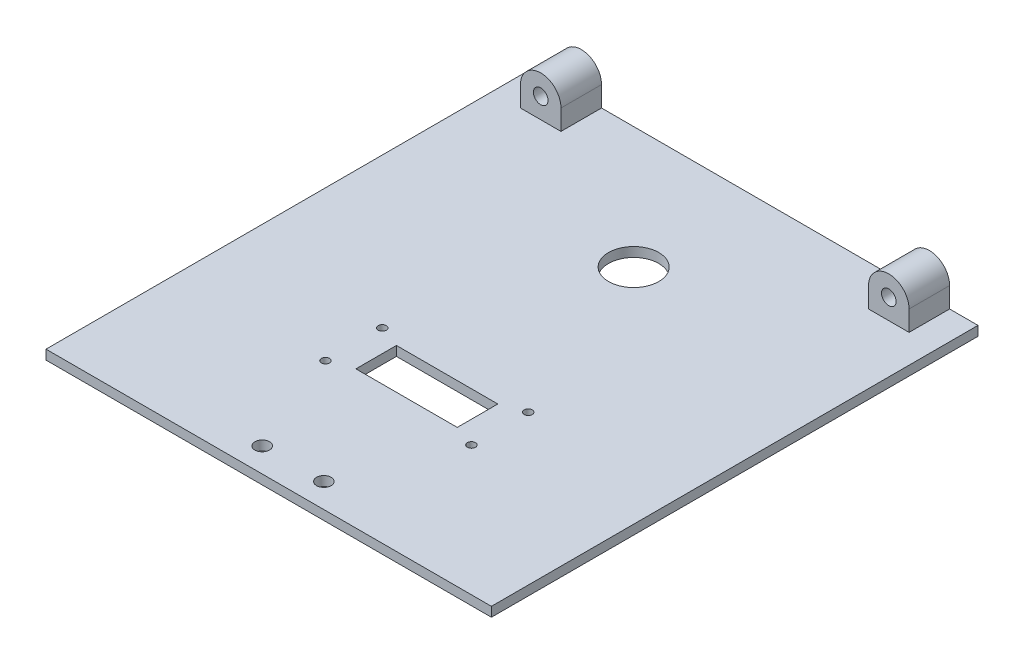
ISO-10303-21;
HEADER;
FILE_DESCRIPTION(('STEP AP214'),'2;1');
FILE_NAME('part.step','',(''),(''),'','','');
FILE_SCHEMA(('AUTOMOTIVE_DESIGN { 1 0 10303 214 1 1 1 1 }'));
ENDSEC;
DATA;
#1=APPLICATION_CONTEXT('core data for automotive mechanical design processes');
#2=APPLICATION_PROTOCOL_DEFINITION('international standard','automotive_design',2000,#1);
#3=PRODUCT_CONTEXT('',#1,'mechanical');
#4=PRODUCT('Part','Part','',(#3));
#5=PRODUCT_RELATED_PRODUCT_CATEGORY('part','',(#4));
#6=PRODUCT_DEFINITION_FORMATION('','',#4);
#7=PRODUCT_DEFINITION_CONTEXT('part definition',#1,'design');
#8=PRODUCT_DEFINITION('design','',#6,#7);
#9=PRODUCT_DEFINITION_SHAPE('','',#8);
#10=(LENGTH_UNIT() NAMED_UNIT(*) SI_UNIT(.MILLI.,.METRE.));
#11=(NAMED_UNIT(*) PLANE_ANGLE_UNIT() SI_UNIT($,.RADIAN.));
#12=(NAMED_UNIT(*) SI_UNIT($,.STERADIAN.) SOLID_ANGLE_UNIT());
#13=UNCERTAINTY_MEASURE_WITH_UNIT(LENGTH_MEASURE(1.E-05),#10,'distance_accuracy_value','');
#14=(GEOMETRIC_REPRESENTATION_CONTEXT(3) GLOBAL_UNCERTAINTY_ASSIGNED_CONTEXT((#13)) GLOBAL_UNIT_ASSIGNED_CONTEXT((#10,
#11,#12)) REPRESENTATION_CONTEXT('',''));
#15=CARTESIAN_POINT('',(0.,0.,0.));
#16=DIRECTION('',(0.,0.,1.));
#17=DIRECTION('',(1.,0.,0.));
#18=AXIS2_PLACEMENT_3D('',#15,#16,#17);
#19=CARTESIAN_POINT('',(0.,6.35,0.));
#20=DIRECTION('',(1.,0.,0.));
#21=DIRECTION('',(0.,0.,-1.));
#22=AXIS2_PLACEMENT_3D('',#19,#20,#21);
#23=PLANE('',#22);
#24=DIRECTION('',(0.,0.,1.));
#25=VECTOR('',#24,1.);
#26=CARTESIAN_POINT('',(0.,2.975,-152.4));
#27=LINE('',#26,#25);
#28=CARTESIAN_POINT('',(0.,2.975,-152.4));
#29=VERTEX_POINT('',#28);
#30=CARTESIAN_POINT('',(0.,2.975,0.));
#31=VERTEX_POINT('',#30);
#32=EDGE_CURVE('E270',#29,#31,#27,.T.);
#33=ORIENTED_EDGE('',*,*,#32,.F.);
#34=DIRECTION('',(0.,-1.,0.));
#35=VECTOR('',#34,1.);
#36=CARTESIAN_POINT('',(0.,6.35,-152.4));
#37=LINE('',#36,#35);
#38=CARTESIAN_POINT('',(0.,0.,-152.4));
#39=VERTEX_POINT('',#38);
#40=EDGE_CURVE('E299',#29,#39,#37,.T.);
#41=ORIENTED_EDGE('',*,*,#40,.T.);
#42=DIRECTION('',(0.,0.,1.));
#43=VECTOR('',#42,1.);
#44=CARTESIAN_POINT('',(0.,0.,0.));
#45=LINE('',#44,#43);
#46=CARTESIAN_POINT('',(0.,0.,0.));
#47=VERTEX_POINT('',#46);
#48=EDGE_CURVE('E286',#39,#47,#45,.T.);
#49=ORIENTED_EDGE('',*,*,#48,.T.);
#50=DIRECTION('',(0.,-1.,0.));
#51=VECTOR('',#50,1.);
#52=CARTESIAN_POINT('',(0.,6.35,0.));
#53=LINE('',#52,#51);
#54=EDGE_CURVE('E305',#31,#47,#53,.T.);
#55=ORIENTED_EDGE('',*,*,#54,.F.);
#56=EDGE_LOOP('',(#33,#41,#49,#55));
#57=FACE_BOUND('',#56,.T.);
#58=ADVANCED_FACE('F36',(#57),#23,.F.);
#59=CARTESIAN_POINT('',(0.,6.35,0.));
#60=DIRECTION('',(0.,0.,-1.));
#61=DIRECTION('',(-1.,0.,0.));
#62=AXIS2_PLACEMENT_3D('',#59,#60,#61);
#63=PLANE('',#62);
#64=DIRECTION('',(1.,0.,0.));
#65=VECTOR('',#64,1.);
#66=CARTESIAN_POINT('',(0.,2.975,0.));
#67=LINE('',#66,#65);
#68=CARTESIAN_POINT('',(139.5,2.975,0.));
#69=VERTEX_POINT('',#68);
#70=EDGE_CURVE('E278',#31,#69,#67,.T.);
#71=ORIENTED_EDGE('',*,*,#70,.F.);
#72=ORIENTED_EDGE('',*,*,#54,.T.);
#73=DIRECTION('',(1.,0.,0.));
#74=VECTOR('',#73,1.);
#75=CARTESIAN_POINT('',(0.,0.,0.));
#76=LINE('',#75,#74);
#77=CARTESIAN_POINT('',(139.5,0.,0.));
#78=VERTEX_POINT('',#77);
#79=EDGE_CURVE('E290',#47,#78,#76,.T.);
#80=ORIENTED_EDGE('',*,*,#79,.T.);
#81=DIRECTION('',(0.,-1.,0.));
#82=VECTOR('',#81,1.);
#83=CARTESIAN_POINT('',(139.5,6.35,0.));
#84=LINE('',#83,#82);
#85=EDGE_CURVE('E303',#69,#78,#84,.T.);
#86=ORIENTED_EDGE('',*,*,#85,.F.);
#87=EDGE_LOOP('',(#71,#72,#80,#86));
#88=FACE_BOUND('',#87,.T.);
#89=ADVANCED_FACE('F376',(#88),#63,.F.);
#90=CARTESIAN_POINT('',(139.5,6.35,0.));
#91=DIRECTION('',(-1.,0.,0.));
#92=DIRECTION('',(0.,0.,1.));
#93=AXIS2_PLACEMENT_3D('',#90,#91,#92);
#94=PLANE('',#93);
#95=DIRECTION('',(0.,0.,-1.));
#96=VECTOR('',#95,1.);
#97=CARTESIAN_POINT('',(139.5,2.975,-152.4));
#98=LINE('',#97,#96);
#99=CARTESIAN_POINT('',(139.5,2.975,-152.4));
#100=VERTEX_POINT('',#99);
#101=EDGE_CURVE('E280',#69,#100,#98,.T.);
#102=ORIENTED_EDGE('',*,*,#101,.F.);
#103=ORIENTED_EDGE('',*,*,#85,.T.);
#104=DIRECTION('',(0.,0.,-1.));
#105=VECTOR('',#104,1.);
#106=CARTESIAN_POINT('',(139.5,0.,0.));
#107=LINE('',#106,#105);
#108=CARTESIAN_POINT('',(139.5,0.,-152.4));
#109=VERTEX_POINT('',#108);
#110=EDGE_CURVE('E293',#78,#109,#107,.T.);
#111=ORIENTED_EDGE('',*,*,#110,.T.);
#112=DIRECTION('',(0.,-1.,0.));
#113=VECTOR('',#112,1.);
#114=CARTESIAN_POINT('',(139.5,6.35,-152.4));
#115=LINE('',#114,#113);
#116=EDGE_CURVE('E301',#100,#109,#115,.T.);
#117=ORIENTED_EDGE('',*,*,#116,.F.);
#118=EDGE_LOOP('',(#102,#103,#111,#117));
#119=FACE_BOUND('',#118,.T.);
#120=ADVANCED_FACE('F381',(#119),#94,.F.);
#121=CARTESIAN_POINT('',(0.,6.35,-152.4));
#122=DIRECTION('',(0.,0.,1.));
#123=DIRECTION('',(1.,0.,0.));
#124=AXIS2_PLACEMENT_3D('',#121,#122,#123);
#125=PLANE('',#124);
#126=DIRECTION('',(-1.,0.,0.));
#127=VECTOR('',#126,1.);
#128=CARTESIAN_POINT('',(0.,2.975,-152.4));
#129=LINE('',#128,#127);
#130=CARTESIAN_POINT('',(130.61,2.975,-152.4));
#131=VERTEX_POINT('',#130);
#132=EDGE_CURVE('E283',#100,#131,#129,.T.);
#133=ORIENTED_EDGE('',*,*,#132,.F.);
#134=ORIENTED_EDGE('',*,*,#116,.T.);
#135=DIRECTION('',(-1.,0.,0.));
#136=VECTOR('',#135,1.);
#137=CARTESIAN_POINT('',(0.,0.,-152.4));
#138=LINE('',#137,#136);
#139=EDGE_CURVE('E296',#109,#39,#138,.T.);
#140=ORIENTED_EDGE('',*,*,#139,.T.);
#141=ORIENTED_EDGE('',*,*,#40,.F.);
#142=CARTESIAN_POINT('',(8.89,2.975,-152.4));
#143=VERTEX_POINT('',#142);
#144=EDGE_CURVE('E282',#143,#29,#129,.T.);
#145=ORIENTED_EDGE('',*,*,#144,.F.);
#146=DIRECTION('',(0.,1.,0.));
#147=VECTOR('',#146,1.);
#148=CARTESIAN_POINT('',(8.89,9.325,-152.4));
#149=LINE('',#148,#147);
#150=CARTESIAN_POINT('',(8.89,9.325,-152.4));
#151=VERTEX_POINT('',#150);
#152=EDGE_CURVE('E215',#143,#151,#149,.T.);
#153=ORIENTED_EDGE('',*,*,#152,.T.);
#154=CARTESIAN_POINT('',(15.24,9.325,-152.4));
#155=DIRECTION('',(0.,0.,-1.));
#156=DIRECTION('',(-1.,0.,0.));
#157=AXIS2_PLACEMENT_3D('',#154,#155,#156);
#158=CIRCLE('',#157,6.35);
#159=CARTESIAN_POINT('',(21.59,9.325,-152.4));
#160=VERTEX_POINT('',#159);
#161=EDGE_CURVE('E207',#151,#160,#158,.T.);
#162=ORIENTED_EDGE('',*,*,#161,.T.);
#163=DIRECTION('',(0.,-1.,0.));
#164=VECTOR('',#163,1.);
#165=CARTESIAN_POINT('',(21.59,9.325,-152.4));
#166=LINE('',#165,#164);
#167=CARTESIAN_POINT('',(21.59,2.975,-152.4));
#168=VERTEX_POINT('',#167);
#169=EDGE_CURVE('E226',#160,#168,#166,.T.);
#170=ORIENTED_EDGE('',*,*,#169,.T.);
#171=CARTESIAN_POINT('',(117.91,2.975,-152.4));
#172=VERTEX_POINT('',#171);
#173=EDGE_CURVE('E287',#172,#168,#129,.T.);
#174=ORIENTED_EDGE('',*,*,#173,.F.);
#175=DIRECTION('',(0.,1.,0.));
#176=VECTOR('',#175,1.);
#177=CARTESIAN_POINT('',(117.91,9.325,-152.4));
#178=LINE('',#177,#176);
#179=CARTESIAN_POINT('',(117.91,9.325,-152.4));
#180=VERTEX_POINT('',#179);
#181=EDGE_CURVE('E251',#172,#180,#178,.T.);
#182=ORIENTED_EDGE('',*,*,#181,.T.);
#183=CARTESIAN_POINT('',(124.26,9.325,-152.4));
#184=DIRECTION('',(0.,0.,-1.));
#185=DIRECTION('',(-1.,0.,0.));
#186=AXIS2_PLACEMENT_3D('',#183,#184,#185);
#187=CIRCLE('',#186,6.35);
#188=CARTESIAN_POINT('',(130.61,9.325,-152.4));
#189=VERTEX_POINT('',#188);
#190=EDGE_CURVE('E244',#180,#189,#187,.T.);
#191=ORIENTED_EDGE('',*,*,#190,.T.);
#192=DIRECTION('',(0.,-1.,0.));
#193=VECTOR('',#192,1.);
#194=CARTESIAN_POINT('',(130.61,9.325,-152.4));
#195=LINE('',#194,#193);
#196=EDGE_CURVE('E263',#189,#131,#195,.T.);
#197=ORIENTED_EDGE('',*,*,#196,.T.);
#198=EDGE_LOOP('',(#133,#134,#140,#141,#145,#153,#162,#170,#174,#182,#191,#197));
#199=FACE_BOUND('',#198,.T.);
#200=CARTESIAN_POINT('',(124.26,9.325,-152.4));
#201=DIRECTION('',(0.,0.,-1.));
#202=DIRECTION('',(-1.,0.,0.));
#203=AXIS2_PLACEMENT_3D('',#200,#201,#202);
#204=CIRCLE('',#203,2.28599999999999);
#205=CARTESIAN_POINT('',(121.974,9.325,-152.4));
#206=VERTEX_POINT('',#205);
#207=EDGE_CURVE('E233',#206,#206,#204,.T.);
#208=ORIENTED_EDGE('',*,*,#207,.F.);
#209=EDGE_LOOP('',(#208));
#210=FACE_BOUND('',#209,.T.);
#211=CARTESIAN_POINT('',(15.24,9.325,-152.4));
#212=DIRECTION('',(0.,0.,-1.));
#213=DIRECTION('',(-1.,0.,0.));
#214=AXIS2_PLACEMENT_3D('',#211,#212,#213);
#215=CIRCLE('',#214,2.286);
#216=CARTESIAN_POINT('',(12.954,9.325,-152.4));
#217=VERTEX_POINT('',#216);
#218=EDGE_CURVE('E208',#217,#217,#215,.T.);
#219=ORIENTED_EDGE('',*,*,#218,.F.);
#220=EDGE_LOOP('',(#219));
#221=FACE_BOUND('',#220,.T.);
#222=ADVANCED_FACE('F350',(#199,#210,#221),#125,.F.);
#223=CARTESIAN_POINT('',(0.,0.,0.));
#224=DIRECTION('',(0.,-1.,0.));
#225=DIRECTION('',(0.,0.,-1.));
#226=AXIS2_PLACEMENT_3D('',#223,#224,#225);
#227=PLANE('',#226);
#228=CARTESIAN_POINT('',(46.89,0.,-58.42));
#229=DIRECTION('',(0.,-1.,0.));
#230=DIRECTION('',(0.,0.,-1.));
#231=AXIS2_PLACEMENT_3D('',#228,#229,#230);
#232=CIRCLE('',#231,1.27);
#233=CARTESIAN_POINT('',(46.89,0.,-59.69));
#234=VERTEX_POINT('',#233);
#235=EDGE_CURVE('E185',#234,#234,#232,.T.);
#236=ORIENTED_EDGE('',*,*,#235,.F.);
#237=EDGE_LOOP('',(#236));
#238=FACE_BOUND('',#237,.T.);
#239=CARTESIAN_POINT('',(92.61,0.,-58.42));
#240=DIRECTION('',(0.,-1.,0.));
#241=DIRECTION('',(0.,0.,-1.));
#242=AXIS2_PLACEMENT_3D('',#239,#240,#241);
#243=CIRCLE('',#242,1.26999999999999);
#244=CARTESIAN_POINT('',(92.61,0.,-59.69));
#245=VERTEX_POINT('',#244);
#246=EDGE_CURVE('E182',#245,#245,#243,.T.);
#247=ORIENTED_EDGE('',*,*,#246,.F.);
#248=EDGE_LOOP('',(#247));
#249=FACE_BOUND('',#248,.T.);
#250=CARTESIAN_POINT('',(92.61,0.,-40.64));
#251=DIRECTION('',(0.,-1.,0.));
#252=DIRECTION('',(0.,0.,-1.));
#253=AXIS2_PLACEMENT_3D('',#250,#251,#252);
#254=CIRCLE('',#253,1.26999999999999);
#255=CARTESIAN_POINT('',(92.61,0.,-41.91));
#256=VERTEX_POINT('',#255);
#257=EDGE_CURVE('E178',#256,#256,#254,.T.);
#258=ORIENTED_EDGE('',*,*,#257,.F.);
#259=EDGE_LOOP('',(#258));
#260=FACE_BOUND('',#259,.T.);
#261=CARTESIAN_POINT('',(46.89,0.,-40.64));
#262=DIRECTION('',(0.,-1.,0.));
#263=DIRECTION('',(0.,0.,-1.));
#264=AXIS2_PLACEMENT_3D('',#261,#262,#263);
#265=CIRCLE('',#264,1.27);
#266=CARTESIAN_POINT('',(46.89,0.,-41.91));
#267=VERTEX_POINT('',#266);
#268=EDGE_CURVE('E174',#267,#267,#265,.T.);
#269=ORIENTED_EDGE('',*,*,#268,.F.);
#270=EDGE_LOOP('',(#269));
#271=FACE_BOUND('',#270,.T.);
#272=DIRECTION('',(0.,0.,-1.));
#273=VECTOR('',#272,1.);
#274=CARTESIAN_POINT('',(53.875,0.,0.));
#275=LINE('',#274,#273);
#276=CARTESIAN_POINT('',(53.875,0.,-43.18));
#277=VERTEX_POINT('',#276);
#278=CARTESIAN_POINT('',(53.875,0.,-55.88));
#279=VERTEX_POINT('',#278);
#280=EDGE_CURVE('E168',#277,#279,#275,.T.);
#281=ORIENTED_EDGE('',*,*,#280,.F.);
#282=DIRECTION('',(-1.,0.,0.));
#283=VECTOR('',#282,1.);
#284=CARTESIAN_POINT('',(0.,0.,-43.18));
#285=LINE('',#284,#283);
#286=CARTESIAN_POINT('',(85.625,0.,-43.18));
#287=VERTEX_POINT('',#286);
#288=EDGE_CURVE('E166',#287,#277,#285,.T.);
#289=ORIENTED_EDGE('',*,*,#288,.F.);
#290=DIRECTION('',(0.,0.,1.));
#291=VECTOR('',#290,1.);
#292=CARTESIAN_POINT('',(85.625,0.,0.));
#293=LINE('',#292,#291);
#294=CARTESIAN_POINT('',(85.625,0.,-55.88));
#295=VERTEX_POINT('',#294);
#296=EDGE_CURVE('E151',#295,#287,#293,.T.);
#297=ORIENTED_EDGE('',*,*,#296,.F.);
#298=DIRECTION('',(1.,0.,0.));
#299=VECTOR('',#298,1.);
#300=CARTESIAN_POINT('',(0.,0.,-55.88));
#301=LINE('',#300,#299);
#302=EDGE_CURVE('E146',#279,#295,#301,.T.);
#303=ORIENTED_EDGE('',*,*,#302,.F.);
#304=EDGE_LOOP('',(#281,#289,#297,#303));
#305=FACE_BOUND('',#304,.T.);
#306=CARTESIAN_POINT('',(60.098,0.,-7.62000000000001));
#307=DIRECTION('',(0.,1.,0.));
#308=DIRECTION('',(0.,0.,1.));
#309=AXIS2_PLACEMENT_3D('',#306,#307,#308);
#310=CIRCLE('',#309,2.28599999999998);
#311=CARTESIAN_POINT('',(60.098,0.,-5.33400000000003));
#312=VERTEX_POINT('',#311);
#313=EDGE_CURVE('E189',#312,#312,#310,.T.);
#314=ORIENTED_EDGE('',*,*,#313,.T.);
#315=EDGE_LOOP('',(#314));
#316=FACE_BOUND('',#315,.T.);
#317=CARTESIAN_POINT('',(79.402,0.,-7.62000000000002));
#318=DIRECTION('',(0.,1.,0.));
#319=DIRECTION('',(0.,0.,1.));
#320=AXIS2_PLACEMENT_3D('',#317,#318,#319);
#321=CIRCLE('',#320,2.28599999999999);
#322=CARTESIAN_POINT('',(79.402,0.,-5.33400000000002));
#323=VERTEX_POINT('',#322);
#324=EDGE_CURVE('E196',#323,#323,#321,.T.);
#325=ORIENTED_EDGE('',*,*,#324,.T.);
#326=EDGE_LOOP('',(#325));
#327=FACE_BOUND('',#326,.T.);
#328=CARTESIAN_POINT('',(69.75,0.,-114.3));
#329=DIRECTION('',(0.,-1.,0.));
#330=DIRECTION('',(0.,0.,-1.));
#331=AXIS2_PLACEMENT_3D('',#328,#329,#330);
#332=CIRCLE('',#331,7.874);
#333=CARTESIAN_POINT('',(69.75,0.,-122.174));
#334=VERTEX_POINT('',#333);
#335=EDGE_CURVE('E192',#334,#334,#332,.T.);
#336=ORIENTED_EDGE('',*,*,#335,.F.);
#337=EDGE_LOOP('',(#336));
#338=FACE_BOUND('',#337,.T.);
#339=ORIENTED_EDGE('',*,*,#48,.F.);
#340=ORIENTED_EDGE('',*,*,#139,.F.);
#341=ORIENTED_EDGE('',*,*,#110,.F.);
#342=ORIENTED_EDGE('',*,*,#79,.F.);
#343=EDGE_LOOP('',(#339,#340,#341,#342));
#344=FACE_BOUND('',#343,.T.);
#345=ADVANCED_FACE('F164',(#238,#249,#260,#271,#305,#316,#327,#338,#344),#227,.T.);
#346=CARTESIAN_POINT('',(0.,2.975,0.));
#347=DIRECTION('',(0.,1.,0.));
#348=DIRECTION('',(0.,0.,1.));
#349=AXIS2_PLACEMENT_3D('',#346,#347,#348);
#350=PLANE('',#349);
#351=CARTESIAN_POINT('',(46.89,2.975,-58.42));
#352=DIRECTION('',(0.,1.,0.));
#353=DIRECTION('',(0.,0.,1.));
#354=AXIS2_PLACEMENT_3D('',#351,#352,#353);
#355=CIRCLE('',#354,1.27);
#356=CARTESIAN_POINT('',(46.89,2.975,-57.15));
#357=VERTEX_POINT('',#356);
#358=EDGE_CURVE('E39',#357,#357,#355,.T.);
#359=ORIENTED_EDGE('',*,*,#358,.F.);
#360=EDGE_LOOP('',(#359));
#361=FACE_BOUND('',#360,.T.);
#362=CARTESIAN_POINT('',(92.61,2.975,-58.42));
#363=DIRECTION('',(0.,1.,0.));
#364=DIRECTION('',(0.,0.,1.));
#365=AXIS2_PLACEMENT_3D('',#362,#363,#364);
#366=CIRCLE('',#365,1.26999999999999);
#367=CARTESIAN_POINT('',(92.61,2.975,-57.15));
#368=VERTEX_POINT('',#367);
#369=EDGE_CURVE('E181',#368,#368,#366,.T.);
#370=ORIENTED_EDGE('',*,*,#369,.F.);
#371=EDGE_LOOP('',(#370));
#372=FACE_BOUND('',#371,.T.);
#373=CARTESIAN_POINT('',(92.61,2.975,-40.64));
#374=DIRECTION('',(0.,1.,0.));
#375=DIRECTION('',(0.,0.,1.));
#376=AXIS2_PLACEMENT_3D('',#373,#374,#375);
#377=CIRCLE('',#376,1.26999999999999);
#378=CARTESIAN_POINT('',(92.61,2.975,-39.37));
#379=VERTEX_POINT('',#378);
#380=EDGE_CURVE('E177',#379,#379,#377,.T.);
#381=ORIENTED_EDGE('',*,*,#380,.F.);
#382=EDGE_LOOP('',(#381));
#383=FACE_BOUND('',#382,.T.);
#384=CARTESIAN_POINT('',(46.89,2.975,-40.64));
#385=DIRECTION('',(0.,1.,0.));
#386=DIRECTION('',(0.,0.,1.));
#387=AXIS2_PLACEMENT_3D('',#384,#385,#386);
#388=CIRCLE('',#387,1.27);
#389=CARTESIAN_POINT('',(46.89,2.975,-39.37));
#390=VERTEX_POINT('',#389);
#391=EDGE_CURVE('E173',#390,#390,#388,.T.);
#392=ORIENTED_EDGE('',*,*,#391,.F.);
#393=EDGE_LOOP('',(#392));
#394=FACE_BOUND('',#393,.T.);
#395=DIRECTION('',(0.,0.,1.));
#396=VECTOR('',#395,1.);
#397=CARTESIAN_POINT('',(53.875,2.975,0.));
#398=LINE('',#397,#396);
#399=CARTESIAN_POINT('',(53.875,2.975,-55.88));
#400=VERTEX_POINT('',#399);
#401=CARTESIAN_POINT('',(53.875,2.975,-43.18));
#402=VERTEX_POINT('',#401);
#403=EDGE_CURVE('E11',#400,#402,#398,.T.);
#404=ORIENTED_EDGE('',*,*,#403,.F.);
#405=DIRECTION('',(-1.,0.,0.));
#406=VECTOR('',#405,1.);
#407=CARTESIAN_POINT('',(0.,2.975,-55.88));
#408=LINE('',#407,#406);
#409=CARTESIAN_POINT('',(85.625,2.975,-55.88));
#410=VERTEX_POINT('',#409);
#411=EDGE_CURVE('E307',#410,#400,#408,.T.);
#412=ORIENTED_EDGE('',*,*,#411,.F.);
#413=DIRECTION('',(0.,0.,-1.));
#414=VECTOR('',#413,1.);
#415=CARTESIAN_POINT('',(85.625,2.975,0.));
#416=LINE('',#415,#414);
#417=CARTESIAN_POINT('',(85.625,2.975,-43.18));
#418=VERTEX_POINT('',#417);
#419=EDGE_CURVE('E159',#418,#410,#416,.T.);
#420=ORIENTED_EDGE('',*,*,#419,.F.);
#421=DIRECTION('',(1.,0.,0.));
#422=VECTOR('',#421,1.);
#423=CARTESIAN_POINT('',(0.,2.975,-43.18));
#424=LINE('',#423,#422);
#425=EDGE_CURVE('E44',#402,#418,#424,.T.);
#426=ORIENTED_EDGE('',*,*,#425,.F.);
#427=EDGE_LOOP('',(#404,#412,#420,#426));
#428=FACE_BOUND('',#427,.T.);
#429=CARTESIAN_POINT('',(60.098,2.975,-7.62000000000001));
#430=DIRECTION('',(0.,1.,0.));
#431=DIRECTION('',(0.,0.,1.));
#432=AXIS2_PLACEMENT_3D('',#429,#430,#431);
#433=CIRCLE('',#432,2.28599999999998);
#434=CARTESIAN_POINT('',(60.098,2.975,-5.33400000000003));
#435=VERTEX_POINT('',#434);
#436=EDGE_CURVE('E193',#435,#435,#433,.T.);
#437=ORIENTED_EDGE('',*,*,#436,.F.);
#438=EDGE_LOOP('',(#437));
#439=FACE_BOUND('',#438,.T.);
#440=CARTESIAN_POINT('',(79.402,2.975,-7.62000000000002));
#441=DIRECTION('',(0.,1.,0.));
#442=DIRECTION('',(0.,0.,1.));
#443=AXIS2_PLACEMENT_3D('',#440,#441,#442);
#444=CIRCLE('',#443,2.28599999999999);
#445=CARTESIAN_POINT('',(79.402,2.975,-5.33400000000002));
#446=VERTEX_POINT('',#445);
#447=EDGE_CURVE('E188',#446,#446,#444,.T.);
#448=ORIENTED_EDGE('',*,*,#447,.F.);
#449=EDGE_LOOP('',(#448));
#450=FACE_BOUND('',#449,.T.);
#451=CARTESIAN_POINT('',(69.75,2.975,-114.3));
#452=DIRECTION('',(0.,1.,0.));
#453=DIRECTION('',(0.,0.,1.));
#454=AXIS2_PLACEMENT_3D('',#451,#452,#453);
#455=CIRCLE('',#454,7.874);
#456=CARTESIAN_POINT('',(69.75,2.975,-106.426));
#457=VERTEX_POINT('',#456);
#458=EDGE_CURVE('E203',#457,#457,#455,.T.);
#459=ORIENTED_EDGE('',*,*,#458,.F.);
#460=EDGE_LOOP('',(#459));
#461=FACE_BOUND('',#460,.T.);
#462=DIRECTION('',(0.,0.,-1.));
#463=VECTOR('',#462,1.);
#464=CARTESIAN_POINT('',(8.89,2.975,-139.7));
#465=LINE('',#464,#463);
#466=CARTESIAN_POINT('',(8.89,2.975,-139.7));
#467=VERTEX_POINT('',#466);
#468=EDGE_CURVE('E234',#467,#143,#465,.T.);
#469=ORIENTED_EDGE('',*,*,#468,.T.);
#470=ORIENTED_EDGE('',*,*,#144,.T.);
#471=ORIENTED_EDGE('',*,*,#32,.T.);
#472=ORIENTED_EDGE('',*,*,#70,.T.);
#473=ORIENTED_EDGE('',*,*,#101,.T.);
#474=ORIENTED_EDGE('',*,*,#132,.T.);
#475=DIRECTION('',(0.,0.,-1.));
#476=VECTOR('',#475,1.);
#477=CARTESIAN_POINT('',(130.61,2.975,-139.7));
#478=LINE('',#477,#476);
#479=CARTESIAN_POINT('',(130.61,2.975,-139.7));
#480=VERTEX_POINT('',#479);
#481=EDGE_CURVE('E274',#480,#131,#478,.T.);
#482=ORIENTED_EDGE('',*,*,#481,.F.);
#483=DIRECTION('',(-1.,0.,0.));
#484=VECTOR('',#483,1.);
#485=CARTESIAN_POINT('',(130.61,2.975,-139.7));
#486=LINE('',#485,#484);
#487=CARTESIAN_POINT('',(117.91,2.975,-139.7));
#488=VERTEX_POINT('',#487);
#489=EDGE_CURVE('E254',#480,#488,#486,.T.);
#490=ORIENTED_EDGE('',*,*,#489,.T.);
#491=DIRECTION('',(0.,0.,-1.));
#492=VECTOR('',#491,1.);
#493=CARTESIAN_POINT('',(117.91,2.975,-139.7));
#494=LINE('',#493,#492);
#495=EDGE_CURVE('E271',#488,#172,#494,.T.);
#496=ORIENTED_EDGE('',*,*,#495,.T.);
#497=ORIENTED_EDGE('',*,*,#173,.T.);
#498=DIRECTION('',(0.,0.,-1.));
#499=VECTOR('',#498,1.);
#500=CARTESIAN_POINT('',(21.59,2.975,-139.7));
#501=LINE('',#500,#499);
#502=CARTESIAN_POINT('',(21.59,2.975,-139.7));
#503=VERTEX_POINT('',#502);
#504=EDGE_CURVE('E237',#503,#168,#501,.T.);
#505=ORIENTED_EDGE('',*,*,#504,.F.);
#506=DIRECTION('',(-1.,0.,0.));
#507=VECTOR('',#506,1.);
#508=CARTESIAN_POINT('',(21.59,2.975,-139.7));
#509=LINE('',#508,#507);
#510=EDGE_CURVE('E218',#503,#467,#509,.T.);
#511=ORIENTED_EDGE('',*,*,#510,.T.);
#512=EDGE_LOOP('',(#469,#470,#471,#472,#473,#474,#482,#490,#496,#497,#505,#511));
#513=FACE_BOUND('',#512,.T.);
#514=ADVANCED_FACE('F321',(#361,#372,#383,#394,#428,#439,#450,#461,#513),#350,.T.);
#515=CARTESIAN_POINT('',(124.26,9.325,-139.7));
#516=DIRECTION('',(0.,0.,-1.));
#517=DIRECTION('',(-1.,0.,0.));
#518=AXIS2_PLACEMENT_3D('',#515,#516,#517);
#519=CYLINDRICAL_SURFACE('',#518,6.35);
#520=ORIENTED_EDGE('',*,*,#190,.F.);
#521=DIRECTION('',(0.,0.,-1.));
#522=VECTOR('',#521,1.);
#523=CARTESIAN_POINT('',(117.91,9.325,-139.7));
#524=LINE('',#523,#522);
#525=CARTESIAN_POINT('',(117.91,9.325,-139.7));
#526=VERTEX_POINT('',#525);
#527=EDGE_CURVE('E268',#526,#180,#524,.T.);
#528=ORIENTED_EDGE('',*,*,#527,.F.);
#529=CARTESIAN_POINT('',(124.26,9.325,-139.7));
#530=DIRECTION('',(0.,0.,-1.));
#531=DIRECTION('',(-1.,0.,0.));
#532=AXIS2_PLACEMENT_3D('',#529,#530,#531);
#533=CIRCLE('',#532,6.35);
#534=CARTESIAN_POINT('',(130.61,9.325,-139.7));
#535=VERTEX_POINT('',#534);
#536=EDGE_CURVE('E247',#526,#535,#533,.T.);
#537=ORIENTED_EDGE('',*,*,#536,.T.);
#538=DIRECTION('',(0.,0.,-1.));
#539=VECTOR('',#538,1.);
#540=CARTESIAN_POINT('',(130.61,9.325,-139.7));
#541=LINE('',#540,#539);
#542=EDGE_CURVE('E260',#535,#189,#541,.T.);
#543=ORIENTED_EDGE('',*,*,#542,.T.);
#544=EDGE_LOOP('',(#520,#528,#537,#543));
#545=FACE_BOUND('',#544,.T.);
#546=ADVANCED_FACE('F324',(#545),#519,.T.);
#547=CARTESIAN_POINT('',(117.91,9.325,-139.7));
#548=DIRECTION('',(-1.,0.,0.));
#549=DIRECTION('',(0.,0.,1.));
#550=AXIS2_PLACEMENT_3D('',#547,#548,#549);
#551=PLANE('',#550);
#552=ORIENTED_EDGE('',*,*,#181,.F.);
#553=ORIENTED_EDGE('',*,*,#495,.F.);
#554=DIRECTION('',(0.,1.,0.));
#555=VECTOR('',#554,1.);
#556=CARTESIAN_POINT('',(117.91,9.325,-139.7));
#557=LINE('',#556,#555);
#558=EDGE_CURVE('E257',#488,#526,#557,.T.);
#559=ORIENTED_EDGE('',*,*,#558,.T.);
#560=ORIENTED_EDGE('',*,*,#527,.T.);
#561=EDGE_LOOP('',(#552,#553,#559,#560));
#562=FACE_BOUND('',#561,.T.);
#563=ADVANCED_FACE('F402',(#562),#551,.T.);
#564=CARTESIAN_POINT('',(130.61,9.325,-139.7));
#565=DIRECTION('',(1.,0.,0.));
#566=DIRECTION('',(0.,0.,-1.));
#567=AXIS2_PLACEMENT_3D('',#564,#565,#566);
#568=PLANE('',#567);
#569=ORIENTED_EDGE('',*,*,#196,.F.);
#570=ORIENTED_EDGE('',*,*,#542,.F.);
#571=DIRECTION('',(0.,-1.,0.));
#572=VECTOR('',#571,1.);
#573=CARTESIAN_POINT('',(130.61,9.325,-139.7));
#574=LINE('',#573,#572);
#575=EDGE_CURVE('E250',#535,#480,#574,.T.);
#576=ORIENTED_EDGE('',*,*,#575,.T.);
#577=ORIENTED_EDGE('',*,*,#481,.T.);
#578=EDGE_LOOP('',(#569,#570,#576,#577));
#579=FACE_BOUND('',#578,.T.);
#580=ADVANCED_FACE('F396',(#579),#568,.T.);
#581=CARTESIAN_POINT('',(124.26,9.325,-139.7));
#582=DIRECTION('',(0.,0.,-1.));
#583=DIRECTION('',(-1.,0.,0.));
#584=AXIS2_PLACEMENT_3D('',#581,#582,#583);
#585=PLANE('',#584);
#586=CARTESIAN_POINT('',(124.26,9.325,-139.7));
#587=DIRECTION('',(0.,0.,-1.));
#588=DIRECTION('',(-1.,0.,0.));
#589=AXIS2_PLACEMENT_3D('',#586,#587,#588);
#590=CIRCLE('',#589,2.28599999999999);
#591=CARTESIAN_POINT('',(121.974,9.325,-139.7));
#592=VERTEX_POINT('',#591);
#593=EDGE_CURVE('E241',#592,#592,#590,.T.);
#594=ORIENTED_EDGE('',*,*,#593,.T.);
#595=EDGE_LOOP('',(#594));
#596=FACE_BOUND('',#595,.T.);
#597=ORIENTED_EDGE('',*,*,#536,.F.);
#598=ORIENTED_EDGE('',*,*,#558,.F.);
#599=ORIENTED_EDGE('',*,*,#489,.F.);
#600=ORIENTED_EDGE('',*,*,#575,.F.);
#601=EDGE_LOOP('',(#597,#598,#599,#600));
#602=FACE_BOUND('',#601,.T.);
#603=ADVANCED_FACE('F371',(#596,#602),#585,.F.);
#604=CARTESIAN_POINT('',(124.26,9.325,-139.7));
#605=DIRECTION('',(0.,0.,-1.));
#606=DIRECTION('',(-1.,0.,0.));
#607=AXIS2_PLACEMENT_3D('',#604,#605,#606);
#608=CYLINDRICAL_SURFACE('',#607,2.28599999999999);
#609=ORIENTED_EDGE('',*,*,#593,.F.);
#610=EDGE_LOOP('',(#609));
#611=FACE_BOUND('',#610,.T.);
#612=ORIENTED_EDGE('',*,*,#207,.T.);
#613=EDGE_LOOP('',(#612));
#614=FACE_BOUND('',#613,.T.);
#615=ADVANCED_FACE('F364',(#611,#614),#608,.F.);
#616=CARTESIAN_POINT('',(15.24,9.325,-139.7));
#617=DIRECTION('',(0.,0.,-1.));
#618=DIRECTION('',(-1.,0.,0.));
#619=AXIS2_PLACEMENT_3D('',#616,#617,#618);
#620=CYLINDRICAL_SURFACE('',#619,6.35);
#621=ORIENTED_EDGE('',*,*,#161,.F.);
#622=DIRECTION('',(0.,0.,-1.));
#623=VECTOR('',#622,1.);
#624=CARTESIAN_POINT('',(8.89,9.325,-139.7));
#625=LINE('',#624,#623);
#626=CARTESIAN_POINT('',(8.89,9.325,-139.7));
#627=VERTEX_POINT('',#626);
#628=EDGE_CURVE('E231',#627,#151,#625,.T.);
#629=ORIENTED_EDGE('',*,*,#628,.F.);
#630=CARTESIAN_POINT('',(15.24,9.325,-139.7));
#631=DIRECTION('',(0.,0.,-1.));
#632=DIRECTION('',(-1.,0.,0.));
#633=AXIS2_PLACEMENT_3D('',#630,#631,#632);
#634=CIRCLE('',#633,6.35);
#635=CARTESIAN_POINT('',(21.59,9.325,-139.7));
#636=VERTEX_POINT('',#635);
#637=EDGE_CURVE('E211',#627,#636,#634,.T.);
#638=ORIENTED_EDGE('',*,*,#637,.T.);
#639=DIRECTION('',(0.,0.,-1.));
#640=VECTOR('',#639,1.);
#641=CARTESIAN_POINT('',(21.59,9.325,-139.7));
#642=LINE('',#641,#640);
#643=EDGE_CURVE('E223',#636,#160,#642,.T.);
#644=ORIENTED_EDGE('',*,*,#643,.T.);
#645=EDGE_LOOP('',(#621,#629,#638,#644));
#646=FACE_BOUND('',#645,.T.);
#647=ADVANCED_FACE('F362',(#646),#620,.T.);
#648=CARTESIAN_POINT('',(8.89,9.325,-139.7));
#649=DIRECTION('',(-1.,0.,0.));
#650=DIRECTION('',(0.,-1.,0.));
#651=AXIS2_PLACEMENT_3D('',#648,#649,#650);
#652=PLANE('',#651);
#653=ORIENTED_EDGE('',*,*,#152,.F.);
#654=ORIENTED_EDGE('',*,*,#468,.F.);
#655=DIRECTION('',(0.,1.,0.));
#656=VECTOR('',#655,1.);
#657=CARTESIAN_POINT('',(8.89,9.325,-139.7));
#658=LINE('',#657,#656);
#659=EDGE_CURVE('E220',#467,#627,#658,.T.);
#660=ORIENTED_EDGE('',*,*,#659,.T.);
#661=ORIENTED_EDGE('',*,*,#628,.T.);
#662=EDGE_LOOP('',(#653,#654,#660,#661));
#663=FACE_BOUND('',#662,.T.);
#664=ADVANCED_FACE('F346',(#663),#652,.T.);
#665=CARTESIAN_POINT('',(21.59,9.325,-139.7));
#666=DIRECTION('',(1.,0.,0.));
#667=DIRECTION('',(0.,1.,0.));
#668=AXIS2_PLACEMENT_3D('',#665,#666,#667);
#669=PLANE('',#668);
#670=ORIENTED_EDGE('',*,*,#169,.F.);
#671=ORIENTED_EDGE('',*,*,#643,.F.);
#672=DIRECTION('',(0.,-1.,0.));
#673=VECTOR('',#672,1.);
#674=CARTESIAN_POINT('',(21.59,9.325,-139.7));
#675=LINE('',#674,#673);
#676=EDGE_CURVE('E214',#636,#503,#675,.T.);
#677=ORIENTED_EDGE('',*,*,#676,.T.);
#678=ORIENTED_EDGE('',*,*,#504,.T.);
#679=EDGE_LOOP('',(#670,#671,#677,#678));
#680=FACE_BOUND('',#679,.T.);
#681=ADVANCED_FACE('F356',(#680),#669,.T.);
#682=CARTESIAN_POINT('',(15.24,9.325,-139.7));
#683=DIRECTION('',(0.,0.,-1.));
#684=DIRECTION('',(-1.,0.,0.));
#685=AXIS2_PLACEMENT_3D('',#682,#683,#684);
#686=PLANE('',#685);
#687=CARTESIAN_POINT('',(15.24,9.325,-139.7));
#688=DIRECTION('',(0.,0.,-1.));
#689=DIRECTION('',(-1.,0.,0.));
#690=AXIS2_PLACEMENT_3D('',#687,#688,#689);
#691=CIRCLE('',#690,2.286);
#692=CARTESIAN_POINT('',(12.954,9.325,-139.7));
#693=VERTEX_POINT('',#692);
#694=EDGE_CURVE('E204',#693,#693,#691,.T.);
#695=ORIENTED_EDGE('',*,*,#694,.T.);
#696=EDGE_LOOP('',(#695));
#697=FACE_BOUND('',#696,.T.);
#698=ORIENTED_EDGE('',*,*,#637,.F.);
#699=ORIENTED_EDGE('',*,*,#659,.F.);
#700=ORIENTED_EDGE('',*,*,#510,.F.);
#701=ORIENTED_EDGE('',*,*,#676,.F.);
#702=EDGE_LOOP('',(#698,#699,#700,#701));
#703=FACE_BOUND('',#702,.T.);
#704=ADVANCED_FACE('F360',(#697,#703),#686,.F.);
#705=CARTESIAN_POINT('',(15.24,9.325,-139.7));
#706=DIRECTION('',(0.,0.,-1.));
#707=DIRECTION('',(-1.,0.,0.));
#708=AXIS2_PLACEMENT_3D('',#705,#706,#707);
#709=CYLINDRICAL_SURFACE('',#708,2.286);
#710=ORIENTED_EDGE('',*,*,#694,.F.);
#711=EDGE_LOOP('',(#710));
#712=FACE_BOUND('',#711,.T.);
#713=ORIENTED_EDGE('',*,*,#218,.T.);
#714=EDGE_LOOP('',(#713));
#715=FACE_BOUND('',#714,.T.);
#716=ADVANCED_FACE('F530',(#712,#715),#709,.F.);
#717=CARTESIAN_POINT('',(69.75,15.675,-114.3));
#718=DIRECTION('',(0.,-1.,0.));
#719=DIRECTION('',(0.,0.,-1.));
#720=AXIS2_PLACEMENT_3D('',#717,#718,#719);
#721=CYLINDRICAL_SURFACE('',#720,7.874);
#722=ORIENTED_EDGE('',*,*,#458,.T.);
#723=EDGE_LOOP('',(#722));
#724=FACE_BOUND('',#723,.T.);
#725=ORIENTED_EDGE('',*,*,#335,.T.);
#726=EDGE_LOOP('',(#725));
#727=FACE_BOUND('',#726,.T.);
#728=ADVANCED_FACE('F526',(#724,#727),#721,.F.);
#729=CARTESIAN_POINT('',(79.402,0.,-7.62000000000002));
#730=DIRECTION('',(0.,1.,0.));
#731=DIRECTION('',(0.,0.,1.));
#732=AXIS2_PLACEMENT_3D('',#729,#730,#731);
#733=CYLINDRICAL_SURFACE('',#732,2.28599999999999);
#734=ORIENTED_EDGE('',*,*,#324,.F.);
#735=EDGE_LOOP('',(#734));
#736=FACE_BOUND('',#735,.T.);
#737=ORIENTED_EDGE('',*,*,#447,.T.);
#738=EDGE_LOOP('',(#737));
#739=FACE_BOUND('',#738,.T.);
#740=ADVANCED_FACE('F522',(#736,#739),#733,.F.);
#741=CARTESIAN_POINT('',(60.098,0.,-7.62000000000001));
#742=DIRECTION('',(0.,1.,0.));
#743=DIRECTION('',(0.,0.,1.));
#744=AXIS2_PLACEMENT_3D('',#741,#742,#743);
#745=CYLINDRICAL_SURFACE('',#744,2.28599999999998);
#746=ORIENTED_EDGE('',*,*,#313,.F.);
#747=EDGE_LOOP('',(#746));
#748=FACE_BOUND('',#747,.T.);
#749=ORIENTED_EDGE('',*,*,#436,.T.);
#750=EDGE_LOOP('',(#749));
#751=FACE_BOUND('',#750,.T.);
#752=ADVANCED_FACE('F448',(#748,#751),#745,.F.);
#753=CARTESIAN_POINT('',(53.875,15.675,-43.18));
#754=DIRECTION('',(-1.,0.,0.));
#755=DIRECTION('',(0.,0.,1.));
#756=AXIS2_PLACEMENT_3D('',#753,#754,#755);
#757=PLANE('',#756);
#758=ORIENTED_EDGE('',*,*,#280,.T.);
#759=DIRECTION('',(0.,-1.,0.));
#760=VECTOR('',#759,1.);
#761=CARTESIAN_POINT('',(53.875,15.675,-55.88));
#762=LINE('',#761,#760);
#763=EDGE_CURVE('E52',#400,#279,#762,.T.);
#764=ORIENTED_EDGE('',*,*,#763,.F.);
#765=ORIENTED_EDGE('',*,*,#403,.T.);
#766=DIRECTION('',(0.,-1.,0.));
#767=VECTOR('',#766,1.);
#768=CARTESIAN_POINT('',(53.875,15.675,-43.18));
#769=LINE('',#768,#767);
#770=EDGE_CURVE('E152',#402,#277,#769,.T.);
#771=ORIENTED_EDGE('',*,*,#770,.T.);
#772=EDGE_LOOP('',(#758,#764,#765,#771));
#773=FACE_BOUND('',#772,.T.);
#774=ADVANCED_FACE('F442',(#773),#757,.F.);
#775=CARTESIAN_POINT('',(53.875,15.675,-43.18));
#776=DIRECTION('',(0.,0.,1.));
#777=DIRECTION('',(1.,0.,0.));
#778=AXIS2_PLACEMENT_3D('',#775,#776,#777);
#779=PLANE('',#778);
#780=ORIENTED_EDGE('',*,*,#288,.T.);
#781=ORIENTED_EDGE('',*,*,#770,.F.);
#782=ORIENTED_EDGE('',*,*,#425,.T.);
#783=DIRECTION('',(0.,-1.,0.));
#784=VECTOR('',#783,1.);
#785=CARTESIAN_POINT('',(85.625,15.675,-43.18));
#786=LINE('',#785,#784);
#787=EDGE_CURVE('E161',#418,#287,#786,.T.);
#788=ORIENTED_EDGE('',*,*,#787,.T.);
#789=EDGE_LOOP('',(#780,#781,#782,#788));
#790=FACE_BOUND('',#789,.T.);
#791=ADVANCED_FACE('F447',(#790),#779,.F.);
#792=CARTESIAN_POINT('',(85.625,15.675,-43.18));
#793=DIRECTION('',(1.,0.,0.));
#794=DIRECTION('',(0.,0.,-1.));
#795=AXIS2_PLACEMENT_3D('',#792,#793,#794);
#796=PLANE('',#795);
#797=ORIENTED_EDGE('',*,*,#296,.T.);
#798=ORIENTED_EDGE('',*,*,#787,.F.);
#799=ORIENTED_EDGE('',*,*,#419,.T.);
#800=DIRECTION('',(0.,-1.,0.));
#801=VECTOR('',#800,1.);
#802=CARTESIAN_POINT('',(85.625,15.675,-55.88));
#803=LINE('',#802,#801);
#804=EDGE_CURVE('E57',#410,#295,#803,.T.);
#805=ORIENTED_EDGE('',*,*,#804,.T.);
#806=EDGE_LOOP('',(#797,#798,#799,#805));
#807=FACE_BOUND('',#806,.T.);
#808=ADVANCED_FACE('F155',(#807),#796,.F.);
#809=CARTESIAN_POINT('',(53.875,15.675,-55.88));
#810=DIRECTION('',(0.,0.,-1.));
#811=DIRECTION('',(-1.,0.,0.));
#812=AXIS2_PLACEMENT_3D('',#809,#810,#811);
#813=PLANE('',#812);
#814=ORIENTED_EDGE('',*,*,#302,.T.);
#815=ORIENTED_EDGE('',*,*,#804,.F.);
#816=ORIENTED_EDGE('',*,*,#411,.T.);
#817=ORIENTED_EDGE('',*,*,#763,.T.);
#818=EDGE_LOOP('',(#814,#815,#816,#817));
#819=FACE_BOUND('',#818,.T.);
#820=ADVANCED_FACE('F147',(#819),#813,.F.);
#821=CARTESIAN_POINT('',(46.89,15.675,-40.64));
#822=DIRECTION('',(0.,-1.,0.));
#823=DIRECTION('',(0.,0.,-1.));
#824=AXIS2_PLACEMENT_3D('',#821,#822,#823);
#825=CYLINDRICAL_SURFACE('',#824,1.27);
#826=ORIENTED_EDGE('',*,*,#268,.T.);
#827=EDGE_LOOP('',(#826));
#828=FACE_BOUND('',#827,.T.);
#829=ORIENTED_EDGE('',*,*,#391,.T.);
#830=EDGE_LOOP('',(#829));
#831=FACE_BOUND('',#830,.T.);
#832=ADVANCED_FACE('F477',(#828,#831),#825,.F.);
#833=CARTESIAN_POINT('',(92.61,15.675,-40.64));
#834=DIRECTION('',(0.,-1.,0.));
#835=DIRECTION('',(0.,0.,-1.));
#836=AXIS2_PLACEMENT_3D('',#833,#834,#835);
#837=CYLINDRICAL_SURFACE('',#836,1.26999999999999);
#838=ORIENTED_EDGE('',*,*,#257,.T.);
#839=EDGE_LOOP('',(#838));
#840=FACE_BOUND('',#839,.T.);
#841=ORIENTED_EDGE('',*,*,#380,.T.);
#842=EDGE_LOOP('',(#841));
#843=FACE_BOUND('',#842,.T.);
#844=ADVANCED_FACE('F486',(#840,#843),#837,.F.);
#845=CARTESIAN_POINT('',(92.61,15.675,-58.42));
#846=DIRECTION('',(0.,-1.,0.));
#847=DIRECTION('',(0.,0.,-1.));
#848=AXIS2_PLACEMENT_3D('',#845,#846,#847);
#849=CYLINDRICAL_SURFACE('',#848,1.26999999999999);
#850=ORIENTED_EDGE('',*,*,#246,.T.);
#851=EDGE_LOOP('',(#850));
#852=FACE_BOUND('',#851,.T.);
#853=ORIENTED_EDGE('',*,*,#369,.T.);
#854=EDGE_LOOP('',(#853));
#855=FACE_BOUND('',#854,.T.);
#856=ADVANCED_FACE('F319',(#852,#855),#849,.F.);
#857=CARTESIAN_POINT('',(46.89,15.675,-58.42));
#858=DIRECTION('',(0.,-1.,0.));
#859=DIRECTION('',(0.,0.,-1.));
#860=AXIS2_PLACEMENT_3D('',#857,#858,#859);
#861=CYLINDRICAL_SURFACE('',#860,1.27);
#862=ORIENTED_EDGE('',*,*,#235,.T.);
#863=EDGE_LOOP('',(#862));
#864=FACE_BOUND('',#863,.T.);
#865=ORIENTED_EDGE('',*,*,#358,.T.);
#866=EDGE_LOOP('',(#865));
#867=FACE_BOUND('',#866,.T.);
#868=ADVANCED_FACE('F505',(#864,#867),#861,.F.);
#869=CLOSED_SHELL('',(#58,#89,#120,#222,#345,#514,#546,#563,#580,#603,#615,#647,#664,#681,#704,
#716,#728,#740,#752,#774,#791,#808,#820,#832,#844,#856,#868));
#870=MANIFOLD_SOLID_BREP('B2',#869);
#871=ADVANCED_BREP_SHAPE_REPRESENTATION('',(#18,#870),#14);
#872=SHAPE_DEFINITION_REPRESENTATION(#9,#871);
ENDSEC;
END-ISO-10303-21;
